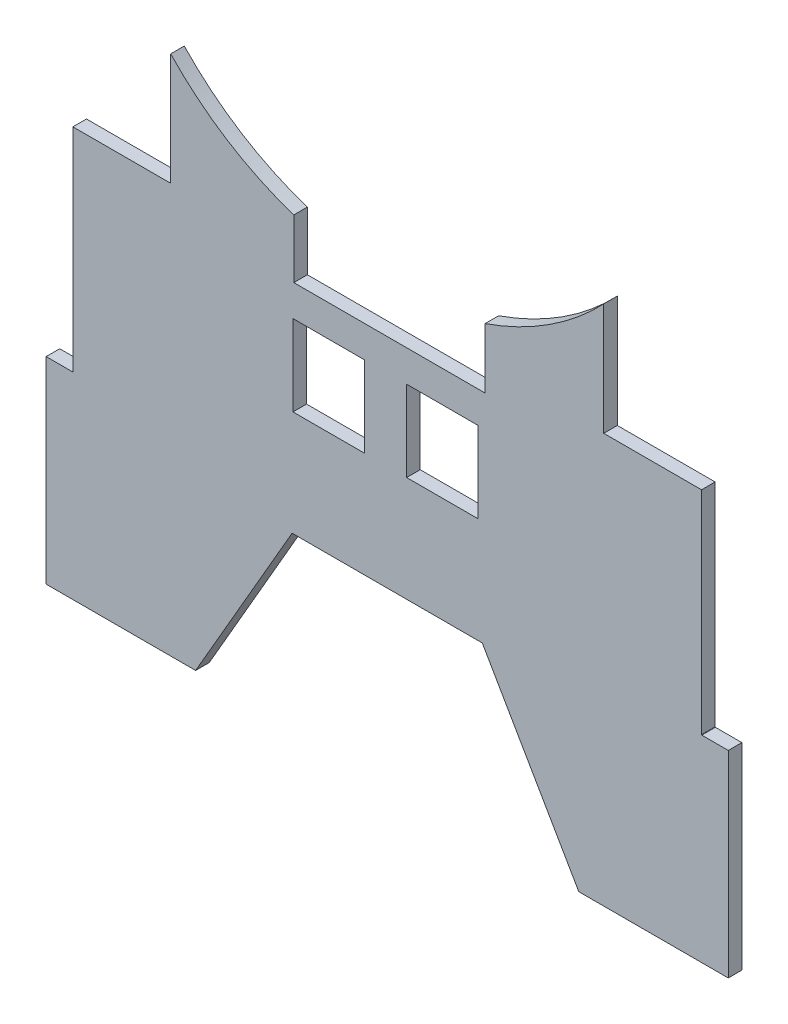
ISO-10303-21;
HEADER;
FILE_DESCRIPTION(('STEP AP214'),'2;1');
FILE_NAME('part.step','',(''),(''),'','','');
FILE_SCHEMA(('AUTOMOTIVE_DESIGN { 1 0 10303 214 1 1 1 1 }'));
ENDSEC;
DATA;
#1=APPLICATION_CONTEXT('core data for automotive mechanical design processes');
#2=APPLICATION_PROTOCOL_DEFINITION('international standard','automotive_design',2000,#1);
#3=PRODUCT_CONTEXT('',#1,'mechanical');
#4=PRODUCT('Part','Part','',(#3));
#5=PRODUCT_RELATED_PRODUCT_CATEGORY('part','',(#4));
#6=PRODUCT_DEFINITION_FORMATION('','',#4);
#7=PRODUCT_DEFINITION_CONTEXT('part definition',#1,'design');
#8=PRODUCT_DEFINITION('design','',#6,#7);
#9=PRODUCT_DEFINITION_SHAPE('','',#8);
#10=(LENGTH_UNIT() NAMED_UNIT(*) SI_UNIT(.MILLI.,.METRE.));
#11=(NAMED_UNIT(*) PLANE_ANGLE_UNIT() SI_UNIT($,.RADIAN.));
#12=(NAMED_UNIT(*) SI_UNIT($,.STERADIAN.) SOLID_ANGLE_UNIT());
#13=UNCERTAINTY_MEASURE_WITH_UNIT(LENGTH_MEASURE(1.E-05),#10,'distance_accuracy_value','');
#14=(GEOMETRIC_REPRESENTATION_CONTEXT(3) GLOBAL_UNCERTAINTY_ASSIGNED_CONTEXT((#13)) GLOBAL_UNIT_ASSIGNED_CONTEXT((#10,
#11,#12)) REPRESENTATION_CONTEXT('',''));
#15=CARTESIAN_POINT('',(0.,0.,0.));
#16=DIRECTION('',(0.,0.,1.));
#17=DIRECTION('',(1.,0.,0.));
#18=AXIS2_PLACEMENT_3D('',#15,#16,#17);
#19=CARTESIAN_POINT('',(-1.19714493905704,164.822133278549,5.));
#20=DIRECTION('',(0.,0.,-1.));
#21=DIRECTION('',(-1.,0.,0.));
#22=AXIS2_PLACEMENT_3D('',#19,#20,#21);
#23=CYLINDRICAL_SURFACE('',#22,110.);
#24=CARTESIAN_POINT('',(-1.19714493905704,164.822133278549,0.));
#25=DIRECTION('',(0.,0.,-1.));
#26=DIRECTION('',(1.,0.,0.));
#27=AXIS2_PLACEMENT_3D('',#24,#25,#26);
#28=CIRCLE('',#27,110.);
#29=CARTESIAN_POINT('',(-35.5816558714338,60.3343090694995,0.));
#30=VERTEX_POINT('',#29);
#31=CARTESIAN_POINT('',(-80.9090868233719,89.0197169514187,0.));
#32=VERTEX_POINT('',#31);
#33=EDGE_CURVE('E286',#30,#32,#28,.T.);
#34=ORIENTED_EDGE('',*,*,#33,.T.);
#35=DIRECTION('',(0.,0.,-1.));
#36=VECTOR('',#35,1.);
#37=CARTESIAN_POINT('',(-80.9090868233719,89.0197169514187,5.));
#38=LINE('',#37,#36);
#39=CARTESIAN_POINT('',(-80.9090868233719,89.0197169514187,5.));
#40=VERTEX_POINT('',#39);
#41=EDGE_CURVE('E253',#32,#40,#38,.F.);
#42=ORIENTED_EDGE('',*,*,#41,.T.);
#43=CARTESIAN_POINT('',(-1.19714493905704,164.822133278549,5.));
#44=DIRECTION('',(0.,0.,-1.));
#45=DIRECTION('',(1.,0.,0.));
#46=AXIS2_PLACEMENT_3D('',#43,#44,#45);
#47=CIRCLE('',#46,110.);
#48=CARTESIAN_POINT('',(-35.5816558714338,60.3343090694995,5.));
#49=VERTEX_POINT('',#48);
#50=EDGE_CURVE('E323',#49,#40,#47,.T.);
#51=ORIENTED_EDGE('',*,*,#50,.F.);
#52=DIRECTION('',(0.,0.,-1.));
#53=VECTOR('',#52,1.);
#54=CARTESIAN_POINT('',(-35.5816558714338,60.3343090694995,5.));
#55=LINE('',#54,#53);
#56=EDGE_CURVE('E358',#49,#30,#55,.T.);
#57=ORIENTED_EDGE('',*,*,#56,.T.);
#58=EDGE_LOOP('',(#34,#42,#51,#57));
#59=FACE_BOUND('',#58,.T.);
#60=ADVANCED_FACE('F35',(#59),#23,.F.);
#61=CARTESIAN_POINT('',(-116.909086823373,54.928897922481,5.));
#62=DIRECTION('',(1.,0.,0.));
#63=DIRECTION('',(0.,1.,0.));
#64=AXIS2_PLACEMENT_3D('',#61,#62,#63);
#65=PLANE('',#64);
#66=DIRECTION('',(0.,-1.,0.));
#67=VECTOR('',#66,1.);
#68=CARTESIAN_POINT('',(-116.909086823373,54.928897922481,5.));
#69=LINE('',#68,#67);
#70=CARTESIAN_POINT('',(-116.909086823373,47.7553737314474,5.));
#71=VERTEX_POINT('',#70);
#72=CARTESIAN_POINT('',(-116.909086823373,-30.4181504595791,5.));
#73=VERTEX_POINT('',#72);
#74=EDGE_CURVE('E326',#71,#73,#69,.T.);
#75=ORIENTED_EDGE('',*,*,#74,.F.);
#76=DIRECTION('',(0.,0.,-1.));
#77=VECTOR('',#76,1.);
#78=CARTESIAN_POINT('',(-116.909086823373,47.7553737314474,5.));
#79=LINE('',#78,#77);
#80=CARTESIAN_POINT('',(-116.909086823373,47.7553737314474,0.));
#81=VERTEX_POINT('',#80);
#82=EDGE_CURVE('E229',#71,#81,#79,.T.);
#83=ORIENTED_EDGE('',*,*,#82,.T.);
#84=DIRECTION('',(0.,-1.,0.));
#85=VECTOR('',#84,1.);
#86=CARTESIAN_POINT('',(-116.909086823373,54.928897922481,0.));
#87=LINE('',#86,#85);
#88=CARTESIAN_POINT('',(-116.909086823373,-30.4181504595791,0.));
#89=VERTEX_POINT('',#88);
#90=EDGE_CURVE('E361',#81,#89,#87,.T.);
#91=ORIENTED_EDGE('',*,*,#90,.T.);
#92=DIRECTION('',(0.,0.,-1.));
#93=VECTOR('',#92,1.);
#94=CARTESIAN_POINT('',(-116.909086823373,-30.4181504595791,5.));
#95=LINE('',#94,#93);
#96=EDGE_CURVE('E434',#73,#89,#95,.T.);
#97=ORIENTED_EDGE('',*,*,#96,.F.);
#98=EDGE_LOOP('',(#75,#83,#91,#97));
#99=FACE_BOUND('',#98,.T.);
#100=ADVANCED_FACE('F502',(#99),#65,.F.);
#101=CARTESIAN_POINT('',(-116.909086823373,-30.4181504595791,5.));
#102=DIRECTION('',(0.,-1.,0.));
#103=DIRECTION('',(0.,0.,-1.));
#104=AXIS2_PLACEMENT_3D('',#101,#102,#103);
#105=PLANE('',#104);
#106=DIRECTION('',(-1.,0.,0.));
#107=VECTOR('',#106,1.);
#108=CARTESIAN_POINT('',(-116.909086823373,-30.4181504595791,0.));
#109=LINE('',#108,#107);
#110=CARTESIAN_POINT('',(-126.752882711947,-30.4181504595791,0.));
#111=VERTEX_POINT('',#110);
#112=EDGE_CURVE('E363',#89,#111,#109,.T.);
#113=ORIENTED_EDGE('',*,*,#112,.T.);
#114=DIRECTION('',(0.,0.,-1.));
#115=VECTOR('',#114,1.);
#116=CARTESIAN_POINT('',(-126.752882711947,-30.4181504595791,5.));
#117=LINE('',#116,#115);
#118=CARTESIAN_POINT('',(-126.752882711947,-30.4181504595791,5.));
#119=VERTEX_POINT('',#118);
#120=EDGE_CURVE('E431',#119,#111,#117,.T.);
#121=ORIENTED_EDGE('',*,*,#120,.F.);
#122=DIRECTION('',(-1.,0.,0.));
#123=VECTOR('',#122,1.);
#124=CARTESIAN_POINT('',(-116.909086823373,-30.4181504595791,5.));
#125=LINE('',#124,#123);
#126=EDGE_CURVE('E329',#73,#119,#125,.T.);
#127=ORIENTED_EDGE('',*,*,#126,.F.);
#128=ORIENTED_EDGE('',*,*,#96,.T.);
#129=EDGE_LOOP('',(#113,#121,#127,#128));
#130=FACE_BOUND('',#129,.T.);
#131=ADVANCED_FACE('F497',(#130),#105,.F.);
#132=CARTESIAN_POINT('',(-126.752882711947,-30.4181504595791,5.));
#133=DIRECTION('',(1.,0.,0.));
#134=DIRECTION('',(0.,0.,-1.));
#135=AXIS2_PLACEMENT_3D('',#132,#133,#134);
#136=PLANE('',#135);
#137=DIRECTION('',(0.,-1.,0.));
#138=VECTOR('',#137,1.);
#139=CARTESIAN_POINT('',(-126.752882711947,-30.4181504595791,0.));
#140=LINE('',#139,#138);
#141=CARTESIAN_POINT('',(-126.752882711947,-102.974632312482,0.));
#142=VERTEX_POINT('',#141);
#143=EDGE_CURVE('E365',#111,#142,#140,.T.);
#144=ORIENTED_EDGE('',*,*,#143,.T.);
#145=DIRECTION('',(0.,0.,-1.));
#146=VECTOR('',#145,1.);
#147=CARTESIAN_POINT('',(-126.752882711947,-102.974632312482,5.));
#148=LINE('',#147,#146);
#149=CARTESIAN_POINT('',(-126.752882711947,-102.974632312482,5.));
#150=VERTEX_POINT('',#149);
#151=EDGE_CURVE('E428',#150,#142,#148,.T.);
#152=ORIENTED_EDGE('',*,*,#151,.F.);
#153=DIRECTION('',(0.,-1.,0.));
#154=VECTOR('',#153,1.);
#155=CARTESIAN_POINT('',(-126.752882711947,-30.4181504595791,5.));
#156=LINE('',#155,#154);
#157=EDGE_CURVE('E331',#119,#150,#156,.T.);
#158=ORIENTED_EDGE('',*,*,#157,.F.);
#159=ORIENTED_EDGE('',*,*,#120,.T.);
#160=EDGE_LOOP('',(#144,#152,#158,#159));
#161=FACE_BOUND('',#160,.T.);
#162=ADVANCED_FACE('F493',(#161),#136,.F.);
#163=CARTESIAN_POINT('',(-126.752882711947,-102.974632312482,5.));
#164=DIRECTION('',(0.,1.,0.));
#165=DIRECTION('',(0.,0.,1.));
#166=AXIS2_PLACEMENT_3D('',#163,#164,#165);
#167=PLANE('',#166);
#168=DIRECTION('',(1.,0.,0.));
#169=VECTOR('',#168,1.);
#170=CARTESIAN_POINT('',(-126.752882711947,-102.974632312482,0.));
#171=LINE('',#170,#169);
#172=CARTESIAN_POINT('',(-71.7199204221136,-102.974632312482,0.));
#173=VERTEX_POINT('',#172);
#174=EDGE_CURVE('E367',#142,#173,#171,.T.);
#175=ORIENTED_EDGE('',*,*,#174,.T.);
#176=DIRECTION('',(0.,0.,-1.));
#177=VECTOR('',#176,1.);
#178=CARTESIAN_POINT('',(-71.7199204221136,-102.974632312482,5.));
#179=LINE('',#178,#177);
#180=CARTESIAN_POINT('',(-71.7199204221136,-102.974632312482,5.));
#181=VERTEX_POINT('',#180);
#182=EDGE_CURVE('E425',#181,#173,#179,.T.);
#183=ORIENTED_EDGE('',*,*,#182,.F.);
#184=DIRECTION('',(1.,0.,0.));
#185=VECTOR('',#184,1.);
#186=CARTESIAN_POINT('',(-126.752882711947,-102.974632312482,5.));
#187=LINE('',#186,#185);
#188=EDGE_CURVE('E333',#150,#181,#187,.T.);
#189=ORIENTED_EDGE('',*,*,#188,.F.);
#190=ORIENTED_EDGE('',*,*,#151,.T.);
#191=EDGE_LOOP('',(#175,#183,#189,#190));
#192=FACE_BOUND('',#191,.T.);
#193=ADVANCED_FACE('F488',(#192),#167,.F.);
#194=CARTESIAN_POINT('',(-71.7199204221136,-102.974632312482,5.));
#195=DIRECTION('',(-0.866025403784446,0.499999999999988,0.));
#196=DIRECTION('',(-0.499999999999988,-0.866025403784446,0.));
#197=AXIS2_PLACEMENT_3D('',#194,#195,#196);
#198=PLANE('',#197);
#199=DIRECTION('',(0.499999999999988,0.866025403784446,0.));
#200=VECTOR('',#199,1.);
#201=CARTESIAN_POINT('',(-71.7199204221136,-102.974632312482,0.));
#202=LINE('',#201,#200);
#203=CARTESIAN_POINT('',(-36.1991816338843,-41.450908008884,0.));
#204=VERTEX_POINT('',#203);
#205=EDGE_CURVE('E369',#173,#204,#202,.T.);
#206=ORIENTED_EDGE('',*,*,#205,.T.);
#207=DIRECTION('',(0.,0.,-1.));
#208=VECTOR('',#207,1.);
#209=CARTESIAN_POINT('',(-36.1991816338843,-41.450908008884,5.));
#210=LINE('',#209,#208);
#211=CARTESIAN_POINT('',(-36.1991816338843,-41.450908008884,5.));
#212=VERTEX_POINT('',#211);
#213=EDGE_CURVE('E422',#212,#204,#210,.T.);
#214=ORIENTED_EDGE('',*,*,#213,.F.);
#215=DIRECTION('',(0.499999999999988,0.866025403784446,0.));
#216=VECTOR('',#215,1.);
#217=CARTESIAN_POINT('',(-71.7199204221136,-102.974632312482,5.));
#218=LINE('',#217,#216);
#219=EDGE_CURVE('E335',#181,#212,#218,.T.);
#220=ORIENTED_EDGE('',*,*,#219,.F.);
#221=ORIENTED_EDGE('',*,*,#182,.T.);
#222=EDGE_LOOP('',(#206,#214,#220,#221));
#223=FACE_BOUND('',#222,.T.);
#224=ADVANCED_FACE('F482',(#223),#198,.F.);
#225=CARTESIAN_POINT('',(-36.1991816338843,-41.450908008884,5.));
#226=DIRECTION('',(0.,1.,0.));
#227=DIRECTION('',(0.,0.,1.));
#228=AXIS2_PLACEMENT_3D('',#225,#226,#227);
#229=PLANE('',#228);
#230=DIRECTION('',(1.,0.,0.));
#231=VECTOR('',#230,1.);
#232=CARTESIAN_POINT('',(-36.1991816338843,-41.450908008884,0.));
#233=LINE('',#232,#231);
#234=CARTESIAN_POINT('',(33.8048917557709,-41.450908008884,0.));
#235=VERTEX_POINT('',#234);
#236=EDGE_CURVE('E371',#204,#235,#233,.T.);
#237=ORIENTED_EDGE('',*,*,#236,.T.);
#238=DIRECTION('',(0.,0.,-1.));
#239=VECTOR('',#238,1.);
#240=CARTESIAN_POINT('',(33.8048917557709,-41.450908008884,5.));
#241=LINE('',#240,#239);
#242=CARTESIAN_POINT('',(33.8048917557709,-41.450908008884,5.));
#243=VERTEX_POINT('',#242);
#244=EDGE_CURVE('E419',#243,#235,#241,.T.);
#245=ORIENTED_EDGE('',*,*,#244,.F.);
#246=DIRECTION('',(1.,0.,0.));
#247=VECTOR('',#246,1.);
#248=CARTESIAN_POINT('',(-36.1991816338843,-41.450908008884,5.));
#249=LINE('',#248,#247);
#250=EDGE_CURVE('E337',#212,#243,#249,.T.);
#251=ORIENTED_EDGE('',*,*,#250,.F.);
#252=ORIENTED_EDGE('',*,*,#213,.T.);
#253=EDGE_LOOP('',(#237,#245,#251,#252));
#254=FACE_BOUND('',#253,.T.);
#255=ADVANCED_FACE('F478',(#254),#229,.F.);
#256=CARTESIAN_POINT('',(33.8048917557709,-41.450908008884,5.));
#257=DIRECTION('',(0.866025403784439,0.5,0.));
#258=DIRECTION('',(-0.5,0.866025403784439,0.));
#259=AXIS2_PLACEMENT_3D('',#256,#257,#258);
#260=PLANE('',#259);
#261=DIRECTION('',(0.5,-0.866025403784439,0.));
#262=VECTOR('',#261,1.);
#263=CARTESIAN_POINT('',(33.8048917557709,-41.450908008884,0.));
#264=LINE('',#263,#262);
#265=CARTESIAN_POINT('',(69.325630543998,-102.974632312476,0.));
#266=VERTEX_POINT('',#265);
#267=EDGE_CURVE('E373',#235,#266,#264,.T.);
#268=ORIENTED_EDGE('',*,*,#267,.T.);
#269=DIRECTION('',(0.,0.,-1.));
#270=VECTOR('',#269,1.);
#271=CARTESIAN_POINT('',(69.325630543998,-102.974632312476,5.));
#272=LINE('',#271,#270);
#273=CARTESIAN_POINT('',(69.325630543998,-102.974632312476,5.));
#274=VERTEX_POINT('',#273);
#275=EDGE_CURVE('E416',#274,#266,#272,.T.);
#276=ORIENTED_EDGE('',*,*,#275,.F.);
#277=DIRECTION('',(0.5,-0.866025403784439,0.));
#278=VECTOR('',#277,1.);
#279=CARTESIAN_POINT('',(33.8048917557709,-41.450908008884,5.));
#280=LINE('',#279,#278);
#281=EDGE_CURVE('E339',#243,#274,#280,.T.);
#282=ORIENTED_EDGE('',*,*,#281,.F.);
#283=ORIENTED_EDGE('',*,*,#244,.T.);
#284=EDGE_LOOP('',(#268,#276,#282,#283));
#285=FACE_BOUND('',#284,.T.);
#286=ADVANCED_FACE('F473',(#285),#260,.F.);
#287=CARTESIAN_POINT('',(69.325630543998,-102.974632312476,5.));
#288=DIRECTION('',(0.,1.,0.));
#289=DIRECTION('',(0.,0.,1.));
#290=AXIS2_PLACEMENT_3D('',#287,#288,#289);
#291=PLANE('',#290);
#292=DIRECTION('',(1.,0.,0.));
#293=VECTOR('',#292,1.);
#294=CARTESIAN_POINT('',(69.325630543998,-102.974632312476,0.));
#295=LINE('',#294,#293);
#296=CARTESIAN_POINT('',(124.358592833834,-102.974632312476,0.));
#297=VERTEX_POINT('',#296);
#298=EDGE_CURVE('E375',#266,#297,#295,.T.);
#299=ORIENTED_EDGE('',*,*,#298,.T.);
#300=DIRECTION('',(0.,0.,-1.));
#301=VECTOR('',#300,1.);
#302=CARTESIAN_POINT('',(124.358592833834,-102.974632312476,5.));
#303=LINE('',#302,#301);
#304=CARTESIAN_POINT('',(124.358592833834,-102.974632312476,5.));
#305=VERTEX_POINT('',#304);
#306=EDGE_CURVE('E413',#305,#297,#303,.T.);
#307=ORIENTED_EDGE('',*,*,#306,.F.);
#308=DIRECTION('',(1.,0.,0.));
#309=VECTOR('',#308,1.);
#310=CARTESIAN_POINT('',(69.325630543998,-102.974632312476,5.));
#311=LINE('',#310,#309);
#312=EDGE_CURVE('E341',#274,#305,#311,.T.);
#313=ORIENTED_EDGE('',*,*,#312,.F.);
#314=ORIENTED_EDGE('',*,*,#275,.T.);
#315=EDGE_LOOP('',(#299,#307,#313,#314));
#316=FACE_BOUND('',#315,.T.);
#317=ADVANCED_FACE('F467',(#316),#291,.F.);
#318=CARTESIAN_POINT('',(124.358592833834,-102.974632312476,5.));
#319=DIRECTION('',(-1.,0.,0.));
#320=DIRECTION('',(0.,-1.,0.));
#321=AXIS2_PLACEMENT_3D('',#318,#319,#320);
#322=PLANE('',#321);
#323=DIRECTION('',(0.,1.,0.));
#324=VECTOR('',#323,1.);
#325=CARTESIAN_POINT('',(124.358592833834,-102.974632312476,0.));
#326=LINE('',#325,#324);
#327=CARTESIAN_POINT('',(124.358592833834,-30.4181504595845,0.));
#328=VERTEX_POINT('',#327);
#329=EDGE_CURVE('E377',#297,#328,#326,.T.);
#330=ORIENTED_EDGE('',*,*,#329,.T.);
#331=DIRECTION('',(0.,0.,-1.));
#332=VECTOR('',#331,1.);
#333=CARTESIAN_POINT('',(124.358592833834,-30.4181504595845,5.));
#334=LINE('',#333,#332);
#335=CARTESIAN_POINT('',(124.358592833834,-30.4181504595845,5.));
#336=VERTEX_POINT('',#335);
#337=EDGE_CURVE('E410',#336,#328,#334,.T.);
#338=ORIENTED_EDGE('',*,*,#337,.F.);
#339=DIRECTION('',(0.,1.,0.));
#340=VECTOR('',#339,1.);
#341=CARTESIAN_POINT('',(124.358592833834,-102.974632312476,5.));
#342=LINE('',#341,#340);
#343=EDGE_CURVE('E343',#305,#336,#342,.T.);
#344=ORIENTED_EDGE('',*,*,#343,.F.);
#345=ORIENTED_EDGE('',*,*,#306,.T.);
#346=EDGE_LOOP('',(#330,#338,#344,#345));
#347=FACE_BOUND('',#346,.T.);
#348=ADVANCED_FACE('F463',(#347),#322,.F.);
#349=CARTESIAN_POINT('',(124.358592833834,-30.4181504595845,5.));
#350=DIRECTION('',(0.,-1.,0.));
#351=DIRECTION('',(0.,0.,-1.));
#352=AXIS2_PLACEMENT_3D('',#349,#350,#351);
#353=PLANE('',#352);
#354=DIRECTION('',(-1.,0.,0.));
#355=VECTOR('',#354,1.);
#356=CARTESIAN_POINT('',(124.358592833834,-30.4181504595845,0.));
#357=LINE('',#356,#355);
#358=CARTESIAN_POINT('',(114.641773970558,-30.4181504595845,0.));
#359=VERTEX_POINT('',#358);
#360=EDGE_CURVE('E379',#328,#359,#357,.T.);
#361=ORIENTED_EDGE('',*,*,#360,.T.);
#362=DIRECTION('',(0.,0.,-1.));
#363=VECTOR('',#362,1.);
#364=CARTESIAN_POINT('',(114.641773970558,-30.4181504595845,5.));
#365=LINE('',#364,#363);
#366=CARTESIAN_POINT('',(114.641773970558,-30.4181504595845,5.));
#367=VERTEX_POINT('',#366);
#368=EDGE_CURVE('E407',#367,#359,#365,.T.);
#369=ORIENTED_EDGE('',*,*,#368,.F.);
#370=DIRECTION('',(-1.,0.,0.));
#371=VECTOR('',#370,1.);
#372=CARTESIAN_POINT('',(124.358592833834,-30.4181504595845,5.));
#373=LINE('',#372,#371);
#374=EDGE_CURVE('E345',#336,#367,#373,.T.);
#375=ORIENTED_EDGE('',*,*,#374,.F.);
#376=ORIENTED_EDGE('',*,*,#337,.T.);
#377=EDGE_LOOP('',(#361,#369,#375,#376));
#378=FACE_BOUND('',#377,.T.);
#379=ADVANCED_FACE('F458',(#378),#353,.F.);
#380=CARTESIAN_POINT('',(114.641773970558,-30.2911734342852,5.));
#381=DIRECTION('',(0.,0.,-1.));
#382=DIRECTION('',(-1.,0.,0.));
#383=AXIS2_PLACEMENT_3D('',#380,#381,#382);
#384=CYLINDRICAL_SURFACE('',#383,0.126977025299305);
#385=CARTESIAN_POINT('',(114.641773970558,-30.2911734342852,0.));
#386=DIRECTION('',(0.,0.,-1.));
#387=DIRECTION('',(1.,0.,0.));
#388=AXIS2_PLACEMENT_3D('',#385,#386,#387);
#389=CIRCLE('',#388,0.126977025299305);
#390=CARTESIAN_POINT('',(114.514796945258,-30.2911734342852,0.));
#391=VERTEX_POINT('',#390);
#392=EDGE_CURVE('E381',#359,#391,#389,.T.);
#393=ORIENTED_EDGE('',*,*,#392,.T.);
#394=DIRECTION('',(0.,0.,-1.));
#395=VECTOR('',#394,1.);
#396=CARTESIAN_POINT('',(114.514796945258,-30.2911734342852,5.));
#397=LINE('',#396,#395);
#398=CARTESIAN_POINT('',(114.514796945258,-30.2911734342852,5.));
#399=VERTEX_POINT('',#398);
#400=EDGE_CURVE('E404',#399,#391,#397,.T.);
#401=ORIENTED_EDGE('',*,*,#400,.F.);
#402=CARTESIAN_POINT('',(114.641773970558,-30.2911734342852,5.));
#403=DIRECTION('',(0.,0.,-1.));
#404=DIRECTION('',(1.,0.,0.));
#405=AXIS2_PLACEMENT_3D('',#402,#403,#404);
#406=CIRCLE('',#405,0.126977025299305);
#407=EDGE_CURVE('E347',#367,#399,#406,.T.);
#408=ORIENTED_EDGE('',*,*,#407,.F.);
#409=ORIENTED_EDGE('',*,*,#368,.T.);
#410=EDGE_LOOP('',(#393,#401,#408,#409));
#411=FACE_BOUND('',#410,.T.);
#412=ADVANCED_FACE('F452',(#411),#384,.F.);
#413=CARTESIAN_POINT('',(114.514796945258,-30.2911734342852,5.));
#414=DIRECTION('',(-1.,0.,0.));
#415=DIRECTION('',(0.,0.,1.));
#416=AXIS2_PLACEMENT_3D('',#413,#414,#415);
#417=PLANE('',#416);
#418=DIRECTION('',(0.,1.,0.));
#419=VECTOR('',#418,1.);
#420=CARTESIAN_POINT('',(114.514796945258,-30.2911734342852,0.));
#421=LINE('',#420,#419);
#422=CARTESIAN_POINT('',(114.514796945258,47.7553737314474,0.));
#423=VERTEX_POINT('',#422);
#424=EDGE_CURVE('E383',#391,#423,#421,.T.);
#425=ORIENTED_EDGE('',*,*,#424,.T.);
#426=DIRECTION('',(0.,0.,1.));
#427=VECTOR('',#426,1.);
#428=CARTESIAN_POINT('',(114.514796945258,47.7553737314474,5.));
#429=LINE('',#428,#427);
#430=CARTESIAN_POINT('',(114.514796945258,47.7553737314474,5.));
#431=VERTEX_POINT('',#430);
#432=EDGE_CURVE('E57',#423,#431,#429,.T.);
#433=ORIENTED_EDGE('',*,*,#432,.T.);
#434=DIRECTION('',(0.,1.,0.));
#435=VECTOR('',#434,1.);
#436=CARTESIAN_POINT('',(114.514796945258,-30.2911734342852,5.));
#437=LINE('',#436,#435);
#438=EDGE_CURVE('E243',#399,#431,#437,.T.);
#439=ORIENTED_EDGE('',*,*,#438,.F.);
#440=ORIENTED_EDGE('',*,*,#400,.T.);
#441=EDGE_LOOP('',(#425,#433,#439,#440));
#442=FACE_BOUND('',#441,.T.);
#443=ADVANCED_FACE('F448',(#442),#417,.F.);
#444=CARTESIAN_POINT('',(-1.19714493905704,164.822133278549,5.));
#445=DIRECTION('',(0.,0.,-1.));
#446=DIRECTION('',(-1.,0.,0.));
#447=AXIS2_PLACEMENT_3D('',#444,#445,#446);
#448=CYLINDRICAL_SURFACE('',#447,110.);
#449=CARTESIAN_POINT('',(-1.19714493905704,164.822133278549,5.));
#450=DIRECTION('',(0.,0.,-1.));
#451=DIRECTION('',(1.,0.,0.));
#452=AXIS2_PLACEMENT_3D('',#449,#450,#451);
#453=CIRCLE('',#452,110.);
#454=CARTESIAN_POINT('',(78.5147969452585,89.0197169514194,5.));
#455=VERTEX_POINT('',#454);
#456=CARTESIAN_POINT('',(34.8186712633337,60.8853208236946,5.));
#457=VERTEX_POINT('',#456);
#458=EDGE_CURVE('E350',#455,#457,#453,.T.);
#459=ORIENTED_EDGE('',*,*,#458,.F.);
#460=DIRECTION('',(0.,0.,-1.));
#461=VECTOR('',#460,1.);
#462=CARTESIAN_POINT('',(78.5147969452585,89.0197169514194,5.));
#463=LINE('',#462,#461);
#464=CARTESIAN_POINT('',(78.5147969452585,89.0197169514194,0.));
#465=VERTEX_POINT('',#464);
#466=EDGE_CURVE('E235',#455,#465,#463,.T.);
#467=ORIENTED_EDGE('',*,*,#466,.T.);
#468=CARTESIAN_POINT('',(-1.19714493905704,164.822133278549,0.));
#469=DIRECTION('',(0.,0.,-1.));
#470=DIRECTION('',(1.,0.,0.));
#471=AXIS2_PLACEMENT_3D('',#468,#469,#470);
#472=CIRCLE('',#471,110.);
#473=CARTESIAN_POINT('',(34.8186712633337,60.8853208236946,0.));
#474=VERTEX_POINT('',#473);
#475=EDGE_CURVE('E386',#465,#474,#472,.T.);
#476=ORIENTED_EDGE('',*,*,#475,.T.);
#477=DIRECTION('',(0.,0.,-1.));
#478=VECTOR('',#477,1.);
#479=CARTESIAN_POINT('',(34.8186712633337,60.8853208236946,5.));
#480=LINE('',#479,#478);
#481=EDGE_CURVE('E401',#457,#474,#480,.T.);
#482=ORIENTED_EDGE('',*,*,#481,.F.);
#483=EDGE_LOOP('',(#459,#467,#476,#482));
#484=FACE_BOUND('',#483,.T.);
#485=ADVANCED_FACE('F528',(#484),#448,.F.);
#486=CARTESIAN_POINT('',(34.8186712633338,60.8853208236946,5.));
#487=DIRECTION('',(1.,0.,0.));
#488=DIRECTION('',(0.,0.,-1.));
#489=AXIS2_PLACEMENT_3D('',#486,#487,#488);
#490=PLANE('',#489);
#491=DIRECTION('',(0.,-1.,0.));
#492=VECTOR('',#491,1.);
#493=CARTESIAN_POINT('',(34.8186712633338,60.8853208236946,0.));
#494=LINE('',#493,#492);
#495=CARTESIAN_POINT('',(34.8186712633338,38.7553737314533,0.));
#496=VERTEX_POINT('',#495);
#497=EDGE_CURVE('E388',#474,#496,#494,.T.);
#498=ORIENTED_EDGE('',*,*,#497,.T.);
#499=DIRECTION('',(0.,0.,-1.));
#500=VECTOR('',#499,1.);
#501=CARTESIAN_POINT('',(34.8186712633338,38.7553737314533,5.));
#502=LINE('',#501,#500);
#503=CARTESIAN_POINT('',(34.8186712633338,38.7553737314533,5.));
#504=VERTEX_POINT('',#503);
#505=EDGE_CURVE('E398',#504,#496,#502,.T.);
#506=ORIENTED_EDGE('',*,*,#505,.F.);
#507=DIRECTION('',(0.,-1.,0.));
#508=VECTOR('',#507,1.);
#509=CARTESIAN_POINT('',(34.8186712633338,60.8853208236946,5.));
#510=LINE('',#509,#508);
#511=EDGE_CURVE('E352',#457,#504,#510,.T.);
#512=ORIENTED_EDGE('',*,*,#511,.F.);
#513=ORIENTED_EDGE('',*,*,#481,.T.);
#514=EDGE_LOOP('',(#498,#506,#512,#513));
#515=FACE_BOUND('',#514,.T.);
#516=ADVANCED_FACE('F525',(#515),#490,.F.);
#517=CARTESIAN_POINT('',(34.8186712633338,38.7553737314533,5.));
#518=DIRECTION('',(0.,-1.,0.));
#519=DIRECTION('',(1.,0.,0.));
#520=AXIS2_PLACEMENT_3D('',#517,#518,#519);
#521=PLANE('',#520);
#522=DIRECTION('',(-1.,0.,0.));
#523=VECTOR('',#522,1.);
#524=CARTESIAN_POINT('',(34.8186712633338,38.7553737314533,0.));
#525=LINE('',#524,#523);
#526=CARTESIAN_POINT('',(-35.5816558714338,38.7553737314533,0.));
#527=VERTEX_POINT('',#526);
#528=EDGE_CURVE('E390',#496,#527,#525,.T.);
#529=ORIENTED_EDGE('',*,*,#528,.T.);
#530=DIRECTION('',(0.,0.,-1.));
#531=VECTOR('',#530,1.);
#532=CARTESIAN_POINT('',(-35.5816558714338,38.7553737314533,5.));
#533=LINE('',#532,#531);
#534=CARTESIAN_POINT('',(-35.5816558714338,38.7553737314533,5.));
#535=VERTEX_POINT('',#534);
#536=EDGE_CURVE('E395',#535,#527,#533,.T.);
#537=ORIENTED_EDGE('',*,*,#536,.F.);
#538=DIRECTION('',(-1.,0.,0.));
#539=VECTOR('',#538,1.);
#540=CARTESIAN_POINT('',(34.8186712633338,38.7553737314533,5.));
#541=LINE('',#540,#539);
#542=EDGE_CURVE('E354',#504,#535,#541,.T.);
#543=ORIENTED_EDGE('',*,*,#542,.F.);
#544=ORIENTED_EDGE('',*,*,#505,.T.);
#545=EDGE_LOOP('',(#529,#537,#543,#544));
#546=FACE_BOUND('',#545,.T.);
#547=ADVANCED_FACE('F521',(#546),#521,.F.);
#548=CARTESIAN_POINT('',(-35.5816558714338,38.7553737314533,5.));
#549=DIRECTION('',(-1.,0.,0.));
#550=DIRECTION('',(0.,-1.,0.));
#551=AXIS2_PLACEMENT_3D('',#548,#549,#550);
#552=PLANE('',#551);
#553=DIRECTION('',(0.,1.,0.));
#554=VECTOR('',#553,1.);
#555=CARTESIAN_POINT('',(-35.5816558714338,38.7553737314533,0.));
#556=LINE('',#555,#554);
#557=EDGE_CURVE('E327',#527,#30,#556,.T.);
#558=ORIENTED_EDGE('',*,*,#557,.T.);
#559=ORIENTED_EDGE('',*,*,#56,.F.);
#560=DIRECTION('',(0.,1.,0.));
#561=VECTOR('',#560,1.);
#562=CARTESIAN_POINT('',(-35.5816558714338,38.7553737314533,5.));
#563=LINE('',#562,#561);
#564=EDGE_CURVE('E356',#535,#49,#563,.T.);
#565=ORIENTED_EDGE('',*,*,#564,.F.);
#566=ORIENTED_EDGE('',*,*,#536,.T.);
#567=EDGE_LOOP('',(#558,#559,#565,#566));
#568=FACE_BOUND('',#567,.T.);
#569=ADVANCED_FACE('F516',(#568),#552,.F.);
#570=CARTESIAN_POINT('',(-1.19714493905704,164.822133278549,5.));
#571=DIRECTION('',(0.,0.,1.));
#572=DIRECTION('',(1.,0.,0.));
#573=AXIS2_PLACEMENT_3D('',#570,#571,#572);
#574=PLANE('',#573);
#575=DIRECTION('',(0.,-1.,0.));
#576=VECTOR('',#575,1.);
#577=CARTESIAN_POINT('',(78.5147969452585,47.7553737314474,5.));
#578=LINE('',#577,#576);
#579=CARTESIAN_POINT('',(78.5147969452585,47.7553737314474,5.));
#580=VERTEX_POINT('',#579);
#581=EDGE_CURVE('E232',#455,#580,#578,.T.);
#582=ORIENTED_EDGE('',*,*,#581,.F.);
#583=ORIENTED_EDGE('',*,*,#458,.T.);
#584=ORIENTED_EDGE('',*,*,#511,.T.);
#585=ORIENTED_EDGE('',*,*,#542,.T.);
#586=ORIENTED_EDGE('',*,*,#564,.T.);
#587=ORIENTED_EDGE('',*,*,#50,.T.);
#588=DIRECTION('',(0.,1.,0.));
#589=VECTOR('',#588,1.);
#590=CARTESIAN_POINT('',(-80.9090868233719,47.7553737314474,5.));
#591=LINE('',#590,#589);
#592=CARTESIAN_POINT('',(-80.9090868233719,47.7553737314474,5.));
#593=VERTEX_POINT('',#592);
#594=EDGE_CURVE('E246',#593,#40,#591,.T.);
#595=ORIENTED_EDGE('',*,*,#594,.F.);
#596=DIRECTION('',(1.,0.,0.));
#597=VECTOR('',#596,1.);
#598=CARTESIAN_POINT('',(-80.9090868233719,47.7553737314474,5.));
#599=LINE('',#598,#597);
#600=EDGE_CURVE('E248',#71,#593,#599,.T.);
#601=ORIENTED_EDGE('',*,*,#600,.F.);
#602=ORIENTED_EDGE('',*,*,#74,.T.);
#603=ORIENTED_EDGE('',*,*,#126,.T.);
#604=ORIENTED_EDGE('',*,*,#157,.T.);
#605=ORIENTED_EDGE('',*,*,#188,.T.);
#606=ORIENTED_EDGE('',*,*,#219,.T.);
#607=ORIENTED_EDGE('',*,*,#250,.T.);
#608=ORIENTED_EDGE('',*,*,#281,.T.);
#609=ORIENTED_EDGE('',*,*,#312,.T.);
#610=ORIENTED_EDGE('',*,*,#343,.T.);
#611=ORIENTED_EDGE('',*,*,#374,.T.);
#612=ORIENTED_EDGE('',*,*,#407,.T.);
#613=ORIENTED_EDGE('',*,*,#438,.T.);
#614=DIRECTION('',(1.,0.,0.));
#615=VECTOR('',#614,1.);
#616=CARTESIAN_POINT('',(78.5147969452585,47.7553737314474,5.));
#617=LINE('',#616,#615);
#618=EDGE_CURVE('E227',#580,#431,#617,.T.);
#619=ORIENTED_EDGE('',*,*,#618,.F.);
#620=EDGE_LOOP('',(#582,#583,#584,#585,#586,#587,#595,#601,#602,#603,#604,#605,#606,#607,#608,
#609,#610,#611,#612,#613,#619));
#621=FACE_BOUND('',#620,.T.);
#622=DIRECTION('',(0.,1.,0.));
#623=VECTOR('',#622,1.);
#624=CARTESIAN_POINT('',(32.3069046872301,27.1353151008472,5.));
#625=LINE('',#624,#623);
#626=CARTESIAN_POINT('',(32.3069046872301,-2.62456763794066,5.));
#627=VERTEX_POINT('',#626);
#628=CARTESIAN_POINT('',(32.3069046872301,27.1353151008472,5.));
#629=VERTEX_POINT('',#628);
#630=EDGE_CURVE('E273',#627,#629,#625,.T.);
#631=ORIENTED_EDGE('',*,*,#630,.F.);
#632=DIRECTION('',(1.,0.,0.));
#633=VECTOR('',#632,1.);
#634=CARTESIAN_POINT('',(32.3069046872301,-2.62456763794066,5.));
#635=LINE('',#634,#633);
#636=CARTESIAN_POINT('',(5.94815140430369,-2.62456763794066,5.));
#637=VERTEX_POINT('',#636);
#638=EDGE_CURVE('E263',#637,#627,#635,.T.);
#639=ORIENTED_EDGE('',*,*,#638,.F.);
#640=DIRECTION('',(0.,-1.,0.));
#641=VECTOR('',#640,1.);
#642=CARTESIAN_POINT('',(5.94815140430369,27.1353151008472,5.));
#643=LINE('',#642,#641);
#644=CARTESIAN_POINT('',(5.94815140430369,27.1353151008472,5.));
#645=VERTEX_POINT('',#644);
#646=EDGE_CURVE('E279',#645,#637,#643,.T.);
#647=ORIENTED_EDGE('',*,*,#646,.F.);
#648=DIRECTION('',(-1.,0.,0.));
#649=VECTOR('',#648,1.);
#650=CARTESIAN_POINT('',(32.3069046872301,27.1353151008472,5.));
#651=LINE('',#650,#649);
#652=EDGE_CURVE('E275',#629,#645,#651,.T.);
#653=ORIENTED_EDGE('',*,*,#652,.F.);
#654=EDGE_LOOP('',(#631,#639,#647,#653));
#655=FACE_BOUND('',#654,.T.);
#656=DIRECTION('',(0.,1.,0.));
#657=VECTOR('',#656,1.);
#658=CARTESIAN_POINT('',(-9.53358449998498,27.1353151008472,5.));
#659=LINE('',#658,#657);
#660=CARTESIAN_POINT('',(-9.53358449998498,-2.62456763794066,5.));
#661=VERTEX_POINT('',#660);
#662=CARTESIAN_POINT('',(-9.53358449998498,27.1353151008472,5.));
#663=VERTEX_POINT('',#662);
#664=EDGE_CURVE('E258',#661,#663,#659,.T.);
#665=ORIENTED_EDGE('',*,*,#664,.F.);
#666=DIRECTION('',(1.,0.,0.));
#667=VECTOR('',#666,1.);
#668=CARTESIAN_POINT('',(-9.53358449998498,-2.62456763794066,5.));
#669=LINE('',#668,#667);
#670=CARTESIAN_POINT('',(-35.8923377829114,-2.62456763794066,5.));
#671=VERTEX_POINT('',#670);
#672=EDGE_CURVE('E297',#671,#661,#669,.T.);
#673=ORIENTED_EDGE('',*,*,#672,.F.);
#674=DIRECTION('',(0.,-1.,0.));
#675=VECTOR('',#674,1.);
#676=CARTESIAN_POINT('',(-35.8923377829114,27.1353151008472,5.));
#677=LINE('',#676,#675);
#678=CARTESIAN_POINT('',(-35.8923377829114,27.1353151008472,5.));
#679=VERTEX_POINT('',#678);
#680=EDGE_CURVE('E311',#679,#671,#677,.T.);
#681=ORIENTED_EDGE('',*,*,#680,.F.);
#682=DIRECTION('',(-1.,0.,0.));
#683=VECTOR('',#682,1.);
#684=CARTESIAN_POINT('',(-9.53358449998498,27.1353151008472,5.));
#685=LINE('',#684,#683);
#686=EDGE_CURVE('E308',#663,#679,#685,.T.);
#687=ORIENTED_EDGE('',*,*,#686,.F.);
#688=EDGE_LOOP('',(#665,#673,#681,#687));
#689=FACE_BOUND('',#688,.T.);
#690=ADVANCED_FACE('F240',(#621,#655,#689),#574,.T.);
#691=CARTESIAN_POINT('',(-1.19714493905704,164.822133278549,0.));
#692=DIRECTION('',(0.,0.,1.));
#693=DIRECTION('',(1.,0.,0.));
#694=AXIS2_PLACEMENT_3D('',#691,#692,#693);
#695=PLANE('',#694);
#696=DIRECTION('',(1.,0.,0.));
#697=VECTOR('',#696,1.);
#698=CARTESIAN_POINT('',(32.3069046872301,-2.62456763794066,0.));
#699=LINE('',#698,#697);
#700=CARTESIAN_POINT('',(5.94815140430369,-2.62456763794066,0.));
#701=VERTEX_POINT('',#700);
#702=CARTESIAN_POINT('',(32.3069046872301,-2.62456763794066,0.));
#703=VERTEX_POINT('',#702);
#704=EDGE_CURVE('E269',#701,#703,#699,.T.);
#705=ORIENTED_EDGE('',*,*,#704,.T.);
#706=DIRECTION('',(0.,1.,0.));
#707=VECTOR('',#706,1.);
#708=CARTESIAN_POINT('',(32.3069046872301,27.1353151008472,0.));
#709=LINE('',#708,#707);
#710=CARTESIAN_POINT('',(32.3069046872301,27.1353151008472,0.));
#711=VERTEX_POINT('',#710);
#712=EDGE_CURVE('E259',#703,#711,#709,.T.);
#713=ORIENTED_EDGE('',*,*,#712,.T.);
#714=DIRECTION('',(-1.,0.,0.));
#715=VECTOR('',#714,1.);
#716=CARTESIAN_POINT('',(32.3069046872301,27.1353151008472,0.));
#717=LINE('',#716,#715);
#718=CARTESIAN_POINT('',(5.94815140430369,27.1353151008472,0.));
#719=VERTEX_POINT('',#718);
#720=EDGE_CURVE('E262',#711,#719,#717,.T.);
#721=ORIENTED_EDGE('',*,*,#720,.T.);
#722=DIRECTION('',(0.,-1.,0.));
#723=VECTOR('',#722,1.);
#724=CARTESIAN_POINT('',(5.94815140430369,27.1353151008472,0.));
#725=LINE('',#724,#723);
#726=EDGE_CURVE('E266',#719,#701,#725,.T.);
#727=ORIENTED_EDGE('',*,*,#726,.T.);
#728=EDGE_LOOP('',(#705,#713,#721,#727));
#729=FACE_BOUND('',#728,.T.);
#730=DIRECTION('',(1.,0.,0.));
#731=VECTOR('',#730,1.);
#732=CARTESIAN_POINT('',(-9.53358449998498,-2.62456763794066,0.));
#733=LINE('',#732,#731);
#734=CARTESIAN_POINT('',(-35.8923377829114,-2.62456763794066,0.));
#735=VERTEX_POINT('',#734);
#736=CARTESIAN_POINT('',(-9.53358449998498,-2.62456763794066,0.));
#737=VERTEX_POINT('',#736);
#738=EDGE_CURVE('E303',#735,#737,#733,.T.);
#739=ORIENTED_EDGE('',*,*,#738,.T.);
#740=DIRECTION('',(0.,1.,0.));
#741=VECTOR('',#740,1.);
#742=CARTESIAN_POINT('',(-9.53358449998498,27.1353151008472,0.));
#743=LINE('',#742,#741);
#744=CARTESIAN_POINT('',(-9.53358449998498,27.1353151008472,0.));
#745=VERTEX_POINT('',#744);
#746=EDGE_CURVE('E293',#737,#745,#743,.T.);
#747=ORIENTED_EDGE('',*,*,#746,.T.);
#748=DIRECTION('',(-1.,0.,0.));
#749=VECTOR('',#748,1.);
#750=CARTESIAN_POINT('',(-9.53358449998498,27.1353151008472,0.));
#751=LINE('',#750,#749);
#752=CARTESIAN_POINT('',(-35.8923377829114,27.1353151008472,0.));
#753=VERTEX_POINT('',#752);
#754=EDGE_CURVE('E296',#745,#753,#751,.T.);
#755=ORIENTED_EDGE('',*,*,#754,.T.);
#756=DIRECTION('',(0.,-1.,0.));
#757=VECTOR('',#756,1.);
#758=CARTESIAN_POINT('',(-35.8923377829114,27.1353151008472,0.));
#759=LINE('',#758,#757);
#760=EDGE_CURVE('E300',#753,#735,#759,.T.);
#761=ORIENTED_EDGE('',*,*,#760,.T.);
#762=EDGE_LOOP('',(#739,#747,#755,#761));
#763=FACE_BOUND('',#762,.T.);
#764=ORIENTED_EDGE('',*,*,#475,.F.);
#765=DIRECTION('',(0.,-1.,0.));
#766=VECTOR('',#765,1.);
#767=CARTESIAN_POINT('',(78.5147969452585,164.822133278549,0.));
#768=LINE('',#767,#766);
#769=CARTESIAN_POINT('',(78.5147969452585,47.7553737314474,0.));
#770=VERTEX_POINT('',#769);
#771=EDGE_CURVE('E11',#465,#770,#768,.T.);
#772=ORIENTED_EDGE('',*,*,#771,.T.);
#773=DIRECTION('',(1.,0.,0.));
#774=VECTOR('',#773,1.);
#775=CARTESIAN_POINT('',(-1.19714493905704,47.7553737314474,0.));
#776=LINE('',#775,#774);
#777=EDGE_CURVE('E42',#770,#423,#776,.T.);
#778=ORIENTED_EDGE('',*,*,#777,.T.);
#779=ORIENTED_EDGE('',*,*,#424,.F.);
#780=ORIENTED_EDGE('',*,*,#392,.F.);
#781=ORIENTED_EDGE('',*,*,#360,.F.);
#782=ORIENTED_EDGE('',*,*,#329,.F.);
#783=ORIENTED_EDGE('',*,*,#298,.F.);
#784=ORIENTED_EDGE('',*,*,#267,.F.);
#785=ORIENTED_EDGE('',*,*,#236,.F.);
#786=ORIENTED_EDGE('',*,*,#205,.F.);
#787=ORIENTED_EDGE('',*,*,#174,.F.);
#788=ORIENTED_EDGE('',*,*,#143,.F.);
#789=ORIENTED_EDGE('',*,*,#112,.F.);
#790=ORIENTED_EDGE('',*,*,#90,.F.);
#791=DIRECTION('',(1.,0.,0.));
#792=VECTOR('',#791,1.);
#793=CARTESIAN_POINT('',(-1.19714493905704,47.7553737314474,0.));
#794=LINE('',#793,#792);
#795=CARTESIAN_POINT('',(-80.9090868233719,47.7553737314474,0.));
#796=VERTEX_POINT('',#795);
#797=EDGE_CURVE('E437',#81,#796,#794,.T.);
#798=ORIENTED_EDGE('',*,*,#797,.T.);
#799=DIRECTION('',(0.,1.,0.));
#800=VECTOR('',#799,1.);
#801=CARTESIAN_POINT('',(-80.9090868233719,164.822133278549,0.));
#802=LINE('',#801,#800);
#803=EDGE_CURVE('E440',#796,#32,#802,.T.);
#804=ORIENTED_EDGE('',*,*,#803,.T.);
#805=ORIENTED_EDGE('',*,*,#33,.F.);
#806=ORIENTED_EDGE('',*,*,#557,.F.);
#807=ORIENTED_EDGE('',*,*,#528,.F.);
#808=ORIENTED_EDGE('',*,*,#497,.F.);
#809=EDGE_LOOP('',(#764,#772,#778,#779,#780,#781,#782,#783,#784,#785,#786,#787,#788,#789,#790,
#798,#804,#805,#806,#807,#808));
#810=FACE_BOUND('',#809,.T.);
#811=ADVANCED_FACE('F445',(#729,#763,#810),#695,.F.);
#812=CARTESIAN_POINT('',(-9.53358449998498,27.1353151008472,0.));
#813=DIRECTION('',(1.,0.,0.));
#814=DIRECTION('',(0.,0.,-1.));
#815=AXIS2_PLACEMENT_3D('',#812,#813,#814);
#816=PLANE('',#815);
#817=ORIENTED_EDGE('',*,*,#664,.T.);
#818=DIRECTION('',(0.,0.,1.));
#819=VECTOR('',#818,1.);
#820=CARTESIAN_POINT('',(-9.53358449998498,27.1353151008472,0.));
#821=LINE('',#820,#819);
#822=EDGE_CURVE('E306',#745,#663,#821,.T.);
#823=ORIENTED_EDGE('',*,*,#822,.F.);
#824=ORIENTED_EDGE('',*,*,#746,.F.);
#825=DIRECTION('',(0.,0.,1.));
#826=VECTOR('',#825,1.);
#827=CARTESIAN_POINT('',(-9.53358449998498,-2.62456763794066,0.));
#828=LINE('',#827,#826);
#829=EDGE_CURVE('E276',#737,#661,#828,.T.);
#830=ORIENTED_EDGE('',*,*,#829,.T.);
#831=EDGE_LOOP('',(#817,#823,#824,#830));
#832=FACE_BOUND('',#831,.T.);
#833=ADVANCED_FACE('F599',(#832),#816,.F.);
#834=CARTESIAN_POINT('',(-9.53358449998498,-2.62456763794066,0.));
#835=DIRECTION('',(0.,-1.,0.));
#836=DIRECTION('',(0.,0.,-1.));
#837=AXIS2_PLACEMENT_3D('',#834,#835,#836);
#838=PLANE('',#837);
#839=ORIENTED_EDGE('',*,*,#672,.T.);
#840=ORIENTED_EDGE('',*,*,#829,.F.);
#841=ORIENTED_EDGE('',*,*,#738,.F.);
#842=DIRECTION('',(0.,0.,1.));
#843=VECTOR('',#842,1.);
#844=CARTESIAN_POINT('',(-35.8923377829114,-2.62456763794066,0.));
#845=LINE('',#844,#843);
#846=EDGE_CURVE('E317',#735,#671,#845,.T.);
#847=ORIENTED_EDGE('',*,*,#846,.T.);
#848=EDGE_LOOP('',(#839,#840,#841,#847));
#849=FACE_BOUND('',#848,.T.);
#850=ADVANCED_FACE('F602',(#849),#838,.F.);
#851=CARTESIAN_POINT('',(-35.8923377829114,27.1353151008472,0.));
#852=DIRECTION('',(-1.,0.,0.));
#853=DIRECTION('',(0.,0.,1.));
#854=AXIS2_PLACEMENT_3D('',#851,#852,#853);
#855=PLANE('',#854);
#856=ORIENTED_EDGE('',*,*,#680,.T.);
#857=ORIENTED_EDGE('',*,*,#846,.F.);
#858=ORIENTED_EDGE('',*,*,#760,.F.);
#859=DIRECTION('',(0.,0.,1.));
#860=VECTOR('',#859,1.);
#861=CARTESIAN_POINT('',(-35.8923377829114,27.1353151008472,0.));
#862=LINE('',#861,#860);
#863=EDGE_CURVE('E319',#753,#679,#862,.T.);
#864=ORIENTED_EDGE('',*,*,#863,.T.);
#865=EDGE_LOOP('',(#856,#857,#858,#864));
#866=FACE_BOUND('',#865,.T.);
#867=ADVANCED_FACE('F610',(#866),#855,.F.);
#868=CARTESIAN_POINT('',(-9.53358449998498,27.1353151008472,0.));
#869=DIRECTION('',(0.,1.,0.));
#870=DIRECTION('',(0.,0.,1.));
#871=AXIS2_PLACEMENT_3D('',#868,#869,#870);
#872=PLANE('',#871);
#873=ORIENTED_EDGE('',*,*,#686,.T.);
#874=ORIENTED_EDGE('',*,*,#863,.F.);
#875=ORIENTED_EDGE('',*,*,#754,.F.);
#876=ORIENTED_EDGE('',*,*,#822,.T.);
#877=EDGE_LOOP('',(#873,#874,#875,#876));
#878=FACE_BOUND('',#877,.T.);
#879=ADVANCED_FACE('F618',(#878),#872,.F.);
#880=CARTESIAN_POINT('',(32.3069046872301,27.1353151008472,0.));
#881=DIRECTION('',(1.,0.,0.));
#882=DIRECTION('',(0.,0.,-1.));
#883=AXIS2_PLACEMENT_3D('',#880,#881,#882);
#884=PLANE('',#883);
#885=ORIENTED_EDGE('',*,*,#630,.T.);
#886=DIRECTION('',(0.,0.,1.));
#887=VECTOR('',#886,1.);
#888=CARTESIAN_POINT('',(32.3069046872301,27.1353151008472,0.));
#889=LINE('',#888,#887);
#890=EDGE_CURVE('E272',#711,#629,#889,.T.);
#891=ORIENTED_EDGE('',*,*,#890,.F.);
#892=ORIENTED_EDGE('',*,*,#712,.F.);
#893=DIRECTION('',(0.,0.,1.));
#894=VECTOR('',#893,1.);
#895=CARTESIAN_POINT('',(32.3069046872301,-2.62456763794066,0.));
#896=LINE('',#895,#894);
#897=EDGE_CURVE('E284',#703,#627,#896,.T.);
#898=ORIENTED_EDGE('',*,*,#897,.T.);
#899=EDGE_LOOP('',(#885,#891,#892,#898));
#900=FACE_BOUND('',#899,.T.);
#901=ADVANCED_FACE('F626',(#900),#884,.F.);
#902=CARTESIAN_POINT('',(32.3069046872301,-2.62456763794066,0.));
#903=DIRECTION('',(0.,-1.,0.));
#904=DIRECTION('',(0.,0.,-1.));
#905=AXIS2_PLACEMENT_3D('',#902,#903,#904);
#906=PLANE('',#905);
#907=ORIENTED_EDGE('',*,*,#638,.T.);
#908=ORIENTED_EDGE('',*,*,#897,.F.);
#909=ORIENTED_EDGE('',*,*,#704,.F.);
#910=DIRECTION('',(0.,0.,1.));
#911=VECTOR('',#910,1.);
#912=CARTESIAN_POINT('',(5.94815140430369,-2.62456763794066,0.));
#913=LINE('',#912,#911);
#914=EDGE_CURVE('E287',#701,#637,#913,.T.);
#915=ORIENTED_EDGE('',*,*,#914,.T.);
#916=EDGE_LOOP('',(#907,#908,#909,#915));
#917=FACE_BOUND('',#916,.T.);
#918=ADVANCED_FACE('F634',(#917),#906,.F.);
#919=CARTESIAN_POINT('',(5.94815140430369,27.1353151008472,0.));
#920=DIRECTION('',(-1.,0.,0.));
#921=DIRECTION('',(0.,0.,1.));
#922=AXIS2_PLACEMENT_3D('',#919,#920,#921);
#923=PLANE('',#922);
#924=ORIENTED_EDGE('',*,*,#646,.T.);
#925=ORIENTED_EDGE('',*,*,#914,.F.);
#926=ORIENTED_EDGE('',*,*,#726,.F.);
#927=DIRECTION('',(0.,0.,1.));
#928=VECTOR('',#927,1.);
#929=CARTESIAN_POINT('',(5.94815140430369,27.1353151008472,0.));
#930=LINE('',#929,#928);
#931=EDGE_CURVE('E289',#719,#645,#930,.T.);
#932=ORIENTED_EDGE('',*,*,#931,.T.);
#933=EDGE_LOOP('',(#924,#925,#926,#932));
#934=FACE_BOUND('',#933,.T.);
#935=ADVANCED_FACE('F642',(#934),#923,.F.);
#936=CARTESIAN_POINT('',(32.3069046872301,27.1353151008472,0.));
#937=DIRECTION('',(0.,1.,0.));
#938=DIRECTION('',(0.,0.,1.));
#939=AXIS2_PLACEMENT_3D('',#936,#937,#938);
#940=PLANE('',#939);
#941=ORIENTED_EDGE('',*,*,#652,.T.);
#942=ORIENTED_EDGE('',*,*,#931,.F.);
#943=ORIENTED_EDGE('',*,*,#720,.F.);
#944=ORIENTED_EDGE('',*,*,#890,.T.);
#945=EDGE_LOOP('',(#941,#942,#943,#944));
#946=FACE_BOUND('',#945,.T.);
#947=ADVANCED_FACE('F650',(#946),#940,.F.);
#948=CARTESIAN_POINT('',(-80.9090868233719,47.7553737314474,-5.));
#949=DIRECTION('',(1.,0.,0.));
#950=DIRECTION('',(0.,0.,-1.));
#951=AXIS2_PLACEMENT_3D('',#948,#949,#950);
#952=PLANE('',#951);
#953=ORIENTED_EDGE('',*,*,#803,.F.);
#954=DIRECTION('',(0.,0.,1.));
#955=VECTOR('',#954,1.);
#956=CARTESIAN_POINT('',(-80.9090868233719,47.7553737314474,-5.));
#957=LINE('',#956,#955);
#958=EDGE_CURVE('E49',#796,#593,#957,.T.);
#959=ORIENTED_EDGE('',*,*,#958,.T.);
#960=ORIENTED_EDGE('',*,*,#594,.T.);
#961=ORIENTED_EDGE('',*,*,#41,.F.);
#962=EDGE_LOOP('',(#953,#959,#960,#961));
#963=FACE_BOUND('',#962,.T.);
#964=ADVANCED_FACE('F508',(#963),#952,.F.);
#965=CARTESIAN_POINT('',(-80.9090868233719,47.7553737314474,-5.));
#966=DIRECTION('',(0.,-1.,0.));
#967=DIRECTION('',(0.,0.,-1.));
#968=AXIS2_PLACEMENT_3D('',#965,#966,#967);
#969=PLANE('',#968);
#970=ORIENTED_EDGE('',*,*,#600,.T.);
#971=ORIENTED_EDGE('',*,*,#958,.F.);
#972=ORIENTED_EDGE('',*,*,#797,.F.);
#973=ORIENTED_EDGE('',*,*,#82,.F.);
#974=EDGE_LOOP('',(#970,#971,#972,#973));
#975=FACE_BOUND('',#974,.T.);
#976=ADVANCED_FACE('F504',(#975),#969,.F.);
#977=CARTESIAN_POINT('',(78.5147969452585,47.7553737314474,-5.));
#978=DIRECTION('',(-1.,0.,0.));
#979=DIRECTION('',(0.,0.,1.));
#980=AXIS2_PLACEMENT_3D('',#977,#978,#979);
#981=PLANE('',#980);
#982=ORIENTED_EDGE('',*,*,#581,.T.);
#983=DIRECTION('',(0.,0.,1.));
#984=VECTOR('',#983,1.);
#985=CARTESIAN_POINT('',(78.5147969452585,47.7553737314474,-5.));
#986=LINE('',#985,#984);
#987=EDGE_CURVE('E223',#770,#580,#986,.T.);
#988=ORIENTED_EDGE('',*,*,#987,.F.);
#989=ORIENTED_EDGE('',*,*,#771,.F.);
#990=ORIENTED_EDGE('',*,*,#466,.F.);
#991=EDGE_LOOP('',(#982,#988,#989,#990));
#992=FACE_BOUND('',#991,.T.);
#993=ADVANCED_FACE('F233',(#992),#981,.F.);
#994=CARTESIAN_POINT('',(78.5147969452585,47.7553737314474,-5.));
#995=DIRECTION('',(0.,-1.,0.));
#996=DIRECTION('',(0.,0.,-1.));
#997=AXIS2_PLACEMENT_3D('',#994,#995,#996);
#998=PLANE('',#997);
#999=ORIENTED_EDGE('',*,*,#777,.F.);
#1000=ORIENTED_EDGE('',*,*,#987,.T.);
#1001=ORIENTED_EDGE('',*,*,#618,.T.);
#1002=ORIENTED_EDGE('',*,*,#432,.F.);
#1003=EDGE_LOOP('',(#999,#1000,#1001,#1002));
#1004=FACE_BOUND('',#1003,.T.);
#1005=ADVANCED_FACE('F225',(#1004),#998,.F.);
#1006=CLOSED_SHELL('',(#60,#100,#131,#162,#193,#224,#255,#286,#317,#348,#379,#412,#443,#485,
#516,#547,#569,#690,#811,#833,#850,#867,#879,#901,#918,#935,#947,#964,#976,#993,#1005));
#1007=MANIFOLD_SOLID_BREP('B2',#1006);
#1008=ADVANCED_BREP_SHAPE_REPRESENTATION('',(#18,#1007),#14);
#1009=SHAPE_DEFINITION_REPRESENTATION(#9,#1008);
ENDSEC;
END-ISO-10303-21;
